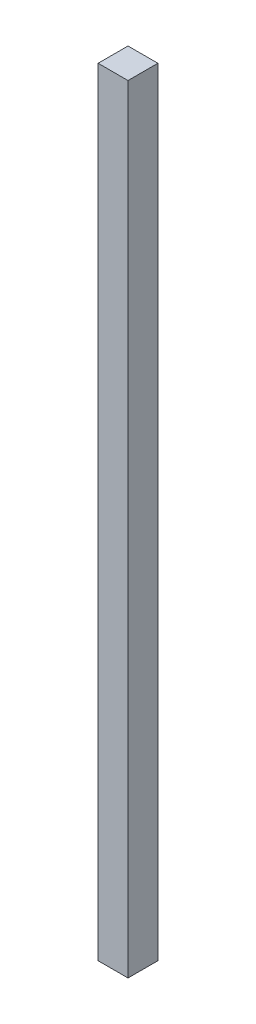
ISO-10303-21;
HEADER;
FILE_DESCRIPTION(('STEP AP214'),'2;1');
FILE_NAME('part.step','',(''),(''),'','','');
FILE_SCHEMA(('AUTOMOTIVE_DESIGN { 1 0 10303 214 1 1 1 1 }'));
ENDSEC;
DATA;
#1=APPLICATION_CONTEXT('core data for automotive mechanical design processes');
#2=APPLICATION_PROTOCOL_DEFINITION('international standard','automotive_design',2000,#1);
#3=PRODUCT_CONTEXT('',#1,'mechanical');
#4=PRODUCT('Part','Part','',(#3));
#5=PRODUCT_RELATED_PRODUCT_CATEGORY('part','',(#4));
#6=PRODUCT_DEFINITION_FORMATION('','',#4);
#7=PRODUCT_DEFINITION_CONTEXT('part definition',#1,'design');
#8=PRODUCT_DEFINITION('design','',#6,#7);
#9=PRODUCT_DEFINITION_SHAPE('','',#8);
#10=(LENGTH_UNIT() NAMED_UNIT(*) SI_UNIT(.MILLI.,.METRE.));
#11=(NAMED_UNIT(*) PLANE_ANGLE_UNIT() SI_UNIT($,.RADIAN.));
#12=(NAMED_UNIT(*) SI_UNIT($,.STERADIAN.) SOLID_ANGLE_UNIT());
#13=UNCERTAINTY_MEASURE_WITH_UNIT(LENGTH_MEASURE(1.E-05),#10,'distance_accuracy_value','');
#14=(GEOMETRIC_REPRESENTATION_CONTEXT(3) GLOBAL_UNCERTAINTY_ASSIGNED_CONTEXT((#13)) GLOBAL_UNIT_ASSIGNED_CONTEXT((#10,
#11,#12)) REPRESENTATION_CONTEXT('',''));
#15=CARTESIAN_POINT('',(0.,0.,0.));
#16=DIRECTION('',(0.,0.,1.));
#17=DIRECTION('',(1.,0.,0.));
#18=AXIS2_PLACEMENT_3D('',#15,#16,#17);
#19=CARTESIAN_POINT('',(2.22044604925031E-13,660.4,-1.11022302462516E-12));
#20=DIRECTION('',(1.,0.,0.));
#21=DIRECTION('',(0.,0.,-1.));
#22=AXIS2_PLACEMENT_3D('',#19,#20,#21);
#23=PLANE('',#22);
#24=DIRECTION('',(0.,0.,1.));
#25=VECTOR('',#24,1.);
#26=CARTESIAN_POINT('',(0.,0.,0.));
#27=LINE('',#26,#25);
#28=CARTESIAN_POINT('',(0.,-2.22044604925031E-13,-25.3999999999999));
#29=VERTEX_POINT('',#28);
#30=CARTESIAN_POINT('',(0.,0.,0.));
#31=VERTEX_POINT('',#30);
#32=EDGE_CURVE('E97',#29,#31,#27,.T.);
#33=ORIENTED_EDGE('',*,*,#32,.T.);
#34=DIRECTION('',(0.,-1.,0.));
#35=VECTOR('',#34,1.);
#36=CARTESIAN_POINT('',(2.22044604925031E-13,660.4,-1.11022302462516E-12));
#37=LINE('',#36,#35);
#38=CARTESIAN_POINT('',(2.22044604925031E-13,660.4,-1.11022302462516E-12));
#39=VERTEX_POINT('',#38);
#40=EDGE_CURVE('E11',#39,#31,#37,.T.);
#41=ORIENTED_EDGE('',*,*,#40,.F.);
#42=DIRECTION('',(0.,0.,1.));
#43=VECTOR('',#42,1.);
#44=CARTESIAN_POINT('',(2.22044604925031E-13,660.4,-1.11022302462516E-12));
#45=LINE('',#44,#43);
#46=CARTESIAN_POINT('',(4.44089209850063E-13,660.4,-25.4000000000001));
#47=VERTEX_POINT('',#46);
#48=EDGE_CURVE('E85',#47,#39,#45,.T.);
#49=ORIENTED_EDGE('',*,*,#48,.F.);
#50=DIRECTION('',(0.,-1.,0.));
#51=VECTOR('',#50,1.);
#52=CARTESIAN_POINT('',(4.44089209850063E-13,660.4,-25.4000000000001));
#53=LINE('',#52,#51);
#54=EDGE_CURVE('E93',#47,#29,#53,.T.);
#55=ORIENTED_EDGE('',*,*,#54,.T.);
#56=EDGE_LOOP('',(#33,#41,#49,#55));
#57=FACE_BOUND('',#56,.T.);
#58=ADVANCED_FACE('F34',(#57),#23,.F.);
#59=CARTESIAN_POINT('',(2.22044604925031E-13,660.4,-1.11022302462516E-12));
#60=DIRECTION('',(0.,0.,-1.));
#61=DIRECTION('',(-1.,0.,0.));
#62=AXIS2_PLACEMENT_3D('',#59,#60,#61);
#63=PLANE('',#62);
#64=DIRECTION('',(1.,0.,0.));
#65=VECTOR('',#64,1.);
#66=CARTESIAN_POINT('',(0.,0.,0.));
#67=LINE('',#66,#65);
#68=CARTESIAN_POINT('',(25.4000000000001,2.22044604925031E-13,2.22044604925031E-13));
#69=VERTEX_POINT('',#68);
#70=EDGE_CURVE('E89',#31,#69,#67,.T.);
#71=ORIENTED_EDGE('',*,*,#70,.T.);
#72=DIRECTION('',(0.,-1.,0.));
#73=VECTOR('',#72,1.);
#74=CARTESIAN_POINT('',(25.3999999999999,660.4,-8.88178419700125E-13));
#75=LINE('',#74,#73);
#76=CARTESIAN_POINT('',(25.3999999999999,660.4,-8.88178419700125E-13));
#77=VERTEX_POINT('',#76);
#78=EDGE_CURVE('E42',#77,#69,#75,.T.);
#79=ORIENTED_EDGE('',*,*,#78,.F.);
#80=DIRECTION('',(1.,0.,0.));
#81=VECTOR('',#80,1.);
#82=CARTESIAN_POINT('',(2.22044604925031E-13,660.4,-1.11022302462516E-12));
#83=LINE('',#82,#81);
#84=EDGE_CURVE('E80',#39,#77,#83,.T.);
#85=ORIENTED_EDGE('',*,*,#84,.F.);
#86=ORIENTED_EDGE('',*,*,#40,.T.);
#87=EDGE_LOOP('',(#71,#79,#85,#86));
#88=FACE_BOUND('',#87,.T.);
#89=ADVANCED_FACE('F88',(#88),#63,.F.);
#90=CARTESIAN_POINT('',(25.3999999999999,660.4,-8.88178419700125E-13));
#91=DIRECTION('',(-1.,0.,0.));
#92=DIRECTION('',(0.,0.,1.));
#93=AXIS2_PLACEMENT_3D('',#90,#91,#92);
#94=PLANE('',#93);
#95=DIRECTION('',(0.,0.,-1.));
#96=VECTOR('',#95,1.);
#97=CARTESIAN_POINT('',(25.4000000000001,2.22044604925031E-13,2.22044604925031E-13));
#98=LINE('',#97,#96);
#99=CARTESIAN_POINT('',(25.4000000000001,2.22044604925031E-13,-25.4000000000001));
#100=VERTEX_POINT('',#99);
#101=EDGE_CURVE('E67',#69,#100,#98,.T.);
#102=ORIENTED_EDGE('',*,*,#101,.T.);
#103=DIRECTION('',(0.,-1.,0.));
#104=VECTOR('',#103,1.);
#105=CARTESIAN_POINT('',(25.4000000000008,660.400000000001,-25.4000000000003));
#106=LINE('',#105,#104);
#107=CARTESIAN_POINT('',(25.4000000000008,660.400000000001,-25.4000000000003));
#108=VERTEX_POINT('',#107);
#109=EDGE_CURVE('E90',#108,#100,#106,.T.);
#110=ORIENTED_EDGE('',*,*,#109,.F.);
#111=DIRECTION('',(0.,0.,-1.));
#112=VECTOR('',#111,1.);
#113=CARTESIAN_POINT('',(25.3999999999999,660.4,-8.88178419700125E-13));
#114=LINE('',#113,#112);
#115=EDGE_CURVE('E83',#77,#108,#114,.T.);
#116=ORIENTED_EDGE('',*,*,#115,.F.);
#117=ORIENTED_EDGE('',*,*,#78,.T.);
#118=EDGE_LOOP('',(#102,#110,#116,#117));
#119=FACE_BOUND('',#118,.T.);
#120=ADVANCED_FACE('F91',(#119),#94,.F.);
#121=CARTESIAN_POINT('',(4.44089209850063E-13,660.4,-25.4000000000001));
#122=DIRECTION('',(0.,0.,1.));
#123=DIRECTION('',(1.,0.,0.));
#124=AXIS2_PLACEMENT_3D('',#121,#122,#123);
#125=PLANE('',#124);
#126=DIRECTION('',(-1.,0.,0.));
#127=VECTOR('',#126,1.);
#128=CARTESIAN_POINT('',(0.,-2.22044604925031E-13,-25.3999999999999));
#129=LINE('',#128,#127);
#130=EDGE_CURVE('E73',#100,#29,#129,.T.);
#131=ORIENTED_EDGE('',*,*,#130,.T.);
#132=ORIENTED_EDGE('',*,*,#54,.F.);
#133=DIRECTION('',(-1.,0.,0.));
#134=VECTOR('',#133,1.);
#135=CARTESIAN_POINT('',(4.44089209850063E-13,660.4,-25.4000000000001));
#136=LINE('',#135,#134);
#137=EDGE_CURVE('E50',#108,#47,#136,.T.);
#138=ORIENTED_EDGE('',*,*,#137,.F.);
#139=ORIENTED_EDGE('',*,*,#109,.T.);
#140=EDGE_LOOP('',(#131,#132,#138,#139));
#141=FACE_BOUND('',#140,.T.);
#142=ADVANCED_FACE('F104',(#141),#125,.F.);
#143=CARTESIAN_POINT('',(2.22044604925031E-13,660.4,-1.11022302462516E-12));
#144=DIRECTION('',(0.,-1.,0.));
#145=DIRECTION('',(0.,0.,-1.));
#146=AXIS2_PLACEMENT_3D('',#143,#144,#145);
#147=PLANE('',#146);
#148=ORIENTED_EDGE('',*,*,#48,.T.);
#149=ORIENTED_EDGE('',*,*,#84,.T.);
#150=ORIENTED_EDGE('',*,*,#115,.T.);
#151=ORIENTED_EDGE('',*,*,#137,.T.);
#152=EDGE_LOOP('',(#148,#149,#150,#151));
#153=FACE_BOUND('',#152,.T.);
#154=ADVANCED_FACE('F81',(#153),#147,.F.);
#155=CARTESIAN_POINT('',(0.,0.,0.));
#156=DIRECTION('',(0.,-1.,0.));
#157=DIRECTION('',(0.,0.,-1.));
#158=AXIS2_PLACEMENT_3D('',#155,#156,#157);
#159=PLANE('',#158);
#160=ORIENTED_EDGE('',*,*,#32,.F.);
#161=ORIENTED_EDGE('',*,*,#130,.F.);
#162=ORIENTED_EDGE('',*,*,#101,.F.);
#163=ORIENTED_EDGE('',*,*,#70,.F.);
#164=EDGE_LOOP('',(#160,#161,#162,#163));
#165=FACE_BOUND('',#164,.T.);
#166=ADVANCED_FACE('F107',(#165),#159,.T.);
#167=CLOSED_SHELL('',(#58,#89,#120,#142,#154,#166));
#168=MANIFOLD_SOLID_BREP('B2',#167);
#169=ADVANCED_BREP_SHAPE_REPRESENTATION('',(#18,#168),#14);
#170=SHAPE_DEFINITION_REPRESENTATION(#9,#169);
ENDSEC;
END-ISO-10303-21;
